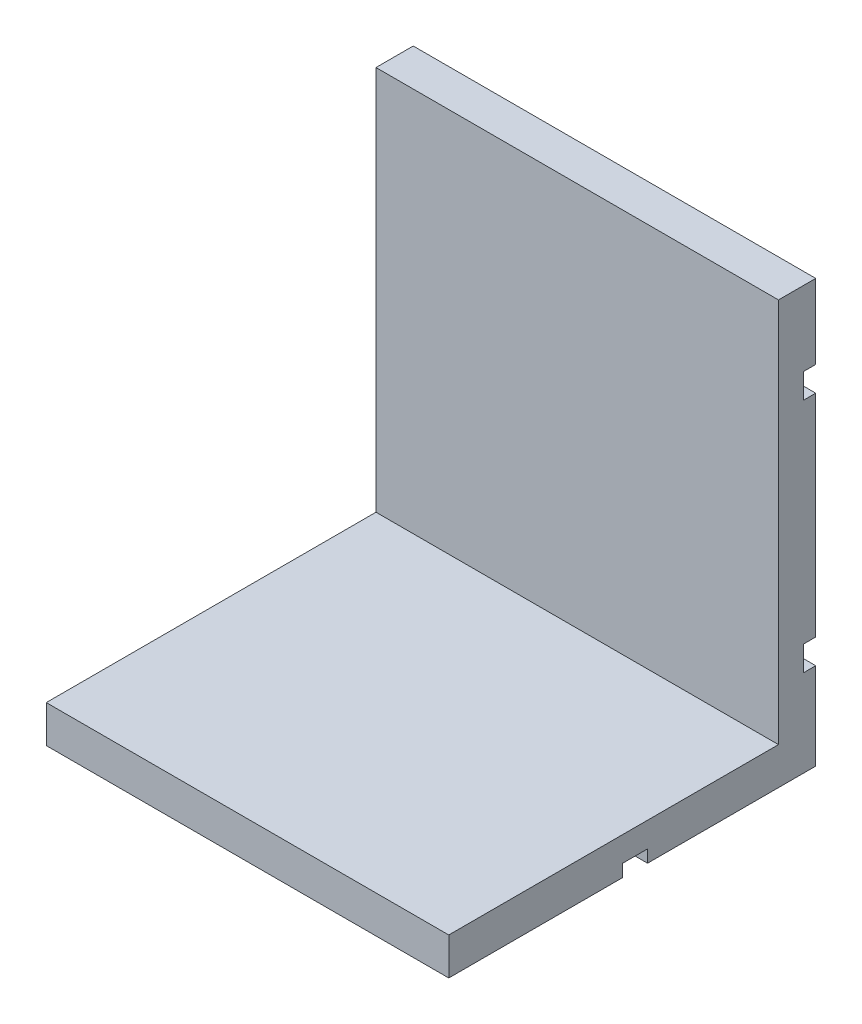
ISO-10303-21;
HEADER;
FILE_DESCRIPTION(('STEP AP214'),'2;1');
FILE_NAME('part.step','',(''),(''),'','','');
FILE_SCHEMA(('AUTOMOTIVE_DESIGN { 1 0 10303 214 1 1 1 1 }'));
ENDSEC;
DATA;
#1=APPLICATION_CONTEXT('core data for automotive mechanical design processes');
#2=APPLICATION_PROTOCOL_DEFINITION('international standard','automotive_design',2000,#1);
#3=PRODUCT_CONTEXT('',#1,'mechanical');
#4=PRODUCT('Part','Part','',(#3));
#5=PRODUCT_RELATED_PRODUCT_CATEGORY('part','',(#4));
#6=PRODUCT_DEFINITION_FORMATION('','',#4);
#7=PRODUCT_DEFINITION_CONTEXT('part definition',#1,'design');
#8=PRODUCT_DEFINITION('design','',#6,#7);
#9=PRODUCT_DEFINITION_SHAPE('','',#8);
#10=(LENGTH_UNIT() NAMED_UNIT(*) SI_UNIT(.MILLI.,.METRE.));
#11=(NAMED_UNIT(*) PLANE_ANGLE_UNIT() SI_UNIT($,.RADIAN.));
#12=(NAMED_UNIT(*) SI_UNIT($,.STERADIAN.) SOLID_ANGLE_UNIT());
#13=UNCERTAINTY_MEASURE_WITH_UNIT(LENGTH_MEASURE(1.E-05),#10,'distance_accuracy_value','');
#14=(GEOMETRIC_REPRESENTATION_CONTEXT(3) GLOBAL_UNCERTAINTY_ASSIGNED_CONTEXT((#13)) GLOBAL_UNIT_ASSIGNED_CONTEXT((#10,
#11,#12)) REPRESENTATION_CONTEXT('',''));
#15=CARTESIAN_POINT('',(0.,0.,0.));
#16=DIRECTION('',(0.,0.,1.));
#17=DIRECTION('',(1.,0.,0.));
#18=AXIS2_PLACEMENT_3D('',#15,#16,#17);
#19=CARTESIAN_POINT('',(16.2,0.,14.77));
#20=DIRECTION('',(0.,0.,-1.));
#21=DIRECTION('',(-1.,0.,0.));
#22=AXIS2_PLACEMENT_3D('',#19,#20,#21);
#23=PLANE('',#22);
#24=DIRECTION('',(0.,-1.,0.));
#25=VECTOR('',#24,1.);
#26=CARTESIAN_POINT('',(0.,0.,14.77));
#27=LINE('',#26,#25);
#28=CARTESIAN_POINT('',(0.,1.5,14.77));
#29=VERTEX_POINT('',#28);
#30=CARTESIAN_POINT('',(0.,0.,14.77));
#31=VERTEX_POINT('',#30);
#32=EDGE_CURVE('E193',#29,#31,#27,.T.);
#33=ORIENTED_EDGE('',*,*,#32,.T.);
#34=DIRECTION('',(-1.,0.,0.));
#35=VECTOR('',#34,1.);
#36=CARTESIAN_POINT('',(16.2,0.,14.77));
#37=LINE('',#36,#35);
#38=CARTESIAN_POINT('',(16.2,0.,14.77));
#39=VERTEX_POINT('',#38);
#40=EDGE_CURVE('E11',#39,#31,#37,.T.);
#41=ORIENTED_EDGE('',*,*,#40,.F.);
#42=DIRECTION('',(0.,-1.,0.));
#43=VECTOR('',#42,1.);
#44=CARTESIAN_POINT('',(16.2,0.,14.77));
#45=LINE('',#44,#43);
#46=CARTESIAN_POINT('',(16.2,1.5,14.77));
#47=VERTEX_POINT('',#46);
#48=EDGE_CURVE('E229',#47,#39,#45,.T.);
#49=ORIENTED_EDGE('',*,*,#48,.F.);
#50=DIRECTION('',(-1.,0.,0.));
#51=VECTOR('',#50,1.);
#52=CARTESIAN_POINT('',(16.2,1.5,14.77));
#53=LINE('',#52,#51);
#54=EDGE_CURVE('E189',#47,#29,#53,.T.);
#55=ORIENTED_EDGE('',*,*,#54,.T.);
#56=EDGE_LOOP('',(#33,#41,#49,#55));
#57=FACE_BOUND('',#56,.T.);
#58=ADVANCED_FACE('F37',(#57),#23,.F.);
#59=CARTESIAN_POINT('',(16.2,0.,0.));
#60=DIRECTION('',(0.,1.,0.));
#61=DIRECTION('',(0.,0.,1.));
#62=AXIS2_PLACEMENT_3D('',#59,#60,#61);
#63=PLANE('',#62);
#64=DIRECTION('',(0.,0.,-1.));
#65=VECTOR('',#64,1.);
#66=CARTESIAN_POINT('',(0.,0.,0.));
#67=LINE('',#66,#65);
#68=CARTESIAN_POINT('',(0.,0.,7.77));
#69=VERTEX_POINT('',#68);
#70=EDGE_CURVE('E196',#31,#69,#67,.T.);
#71=ORIENTED_EDGE('',*,*,#70,.T.);
#72=DIRECTION('',(-1.,0.,0.));
#73=VECTOR('',#72,1.);
#74=CARTESIAN_POINT('',(16.2,0.,7.77));
#75=LINE('',#74,#73);
#76=CARTESIAN_POINT('',(16.2,0.,7.77));
#77=VERTEX_POINT('',#76);
#78=EDGE_CURVE('E45',#77,#69,#75,.T.);
#79=ORIENTED_EDGE('',*,*,#78,.F.);
#80=DIRECTION('',(0.,0.,-1.));
#81=VECTOR('',#80,1.);
#82=CARTESIAN_POINT('',(16.2,0.,0.));
#83=LINE('',#82,#81);
#84=EDGE_CURVE('E126',#39,#77,#83,.T.);
#85=ORIENTED_EDGE('',*,*,#84,.F.);
#86=ORIENTED_EDGE('',*,*,#40,.T.);
#87=EDGE_LOOP('',(#71,#79,#85,#86));
#88=FACE_BOUND('',#87,.T.);
#89=ADVANCED_FACE('F335',(#88),#63,.F.);
#90=CARTESIAN_POINT('',(16.2,0.,7.77));
#91=DIRECTION('',(0.,0.,1.));
#92=DIRECTION('',(1.,0.,0.));
#93=AXIS2_PLACEMENT_3D('',#90,#91,#92);
#94=PLANE('',#93);
#95=DIRECTION('',(0.,1.,0.));
#96=VECTOR('',#95,1.);
#97=CARTESIAN_POINT('',(0.,0.,7.77));
#98=LINE('',#97,#96);
#99=CARTESIAN_POINT('',(0.,0.499999999999999,7.77));
#100=VERTEX_POINT('',#99);
#101=EDGE_CURVE('E198',#69,#100,#98,.T.);
#102=ORIENTED_EDGE('',*,*,#101,.T.);
#103=DIRECTION('',(-1.,0.,0.));
#104=VECTOR('',#103,1.);
#105=CARTESIAN_POINT('',(16.2,0.499999999999999,7.77));
#106=LINE('',#105,#104);
#107=CARTESIAN_POINT('',(16.2,0.499999999999999,7.77));
#108=VERTEX_POINT('',#107);
#109=EDGE_CURVE('E264',#108,#100,#106,.T.);
#110=ORIENTED_EDGE('',*,*,#109,.F.);
#111=DIRECTION('',(0.,1.,0.));
#112=VECTOR('',#111,1.);
#113=CARTESIAN_POINT('',(16.2,0.,7.77));
#114=LINE('',#113,#112);
#115=EDGE_CURVE('E272',#77,#108,#114,.T.);
#116=ORIENTED_EDGE('',*,*,#115,.F.);
#117=ORIENTED_EDGE('',*,*,#78,.T.);
#118=EDGE_LOOP('',(#102,#110,#116,#117));
#119=FACE_BOUND('',#118,.T.);
#120=ADVANCED_FACE('F270',(#119),#94,.F.);
#121=CARTESIAN_POINT('',(16.2,0.499999999999999,0.));
#122=DIRECTION('',(0.,1.,0.));
#123=DIRECTION('',(0.,0.,1.));
#124=AXIS2_PLACEMENT_3D('',#121,#122,#123);
#125=PLANE('',#124);
#126=DIRECTION('',(0.,0.,-1.));
#127=VECTOR('',#126,1.);
#128=CARTESIAN_POINT('',(0.,0.499999999999999,0.));
#129=LINE('',#128,#127);
#130=CARTESIAN_POINT('',(0.,0.499999999999999,6.77));
#131=VERTEX_POINT('',#130);
#132=EDGE_CURVE('E200',#100,#131,#129,.T.);
#133=ORIENTED_EDGE('',*,*,#132,.T.);
#134=DIRECTION('',(-1.,0.,0.));
#135=VECTOR('',#134,1.);
#136=CARTESIAN_POINT('',(16.2,0.499999999999999,6.77));
#137=LINE('',#136,#135);
#138=CARTESIAN_POINT('',(16.2,0.499999999999999,6.77));
#139=VERTEX_POINT('',#138);
#140=EDGE_CURVE('E261',#139,#131,#137,.T.);
#141=ORIENTED_EDGE('',*,*,#140,.F.);
#142=DIRECTION('',(0.,0.,-1.));
#143=VECTOR('',#142,1.);
#144=CARTESIAN_POINT('',(16.2,0.499999999999999,0.));
#145=LINE('',#144,#143);
#146=EDGE_CURVE('E290',#108,#139,#145,.T.);
#147=ORIENTED_EDGE('',*,*,#146,.F.);
#148=ORIENTED_EDGE('',*,*,#109,.T.);
#149=EDGE_LOOP('',(#133,#141,#147,#148));
#150=FACE_BOUND('',#149,.T.);
#151=ADVANCED_FACE('F280',(#150),#125,.F.);
#152=CARTESIAN_POINT('',(16.2,0.,6.77));
#153=DIRECTION('',(0.,0.,-1.));
#154=DIRECTION('',(-1.,0.,0.));
#155=AXIS2_PLACEMENT_3D('',#152,#153,#154);
#156=PLANE('',#155);
#157=DIRECTION('',(0.,-1.,0.));
#158=VECTOR('',#157,1.);
#159=CARTESIAN_POINT('',(0.,0.,6.77));
#160=LINE('',#159,#158);
#161=CARTESIAN_POINT('',(0.,0.,6.77));
#162=VERTEX_POINT('',#161);
#163=EDGE_CURVE('E202',#131,#162,#160,.T.);
#164=ORIENTED_EDGE('',*,*,#163,.T.);
#165=DIRECTION('',(-1.,0.,0.));
#166=VECTOR('',#165,1.);
#167=CARTESIAN_POINT('',(16.2,0.,6.77));
#168=LINE('',#167,#166);
#169=CARTESIAN_POINT('',(16.2,0.,6.77));
#170=VERTEX_POINT('',#169);
#171=EDGE_CURVE('E259',#170,#162,#168,.T.);
#172=ORIENTED_EDGE('',*,*,#171,.F.);
#173=DIRECTION('',(0.,-1.,0.));
#174=VECTOR('',#173,1.);
#175=CARTESIAN_POINT('',(16.2,0.,6.77));
#176=LINE('',#175,#174);
#177=EDGE_CURVE('E286',#139,#170,#176,.T.);
#178=ORIENTED_EDGE('',*,*,#177,.F.);
#179=ORIENTED_EDGE('',*,*,#140,.T.);
#180=EDGE_LOOP('',(#164,#172,#178,#179));
#181=FACE_BOUND('',#180,.T.);
#182=ADVANCED_FACE('F284',(#181),#156,.F.);
#183=CARTESIAN_POINT('',(16.2,0.,0.));
#184=DIRECTION('',(0.,-1.,0.));
#185=DIRECTION('',(0.,0.,-1.));
#186=AXIS2_PLACEMENT_3D('',#183,#184,#185);
#187=PLANE('',#186);
#188=DIRECTION('',(0.,0.,1.));
#189=VECTOR('',#188,1.);
#190=CARTESIAN_POINT('',(0.,0.,0.));
#191=LINE('',#190,#189);
#192=CARTESIAN_POINT('',(0.,0.,0.));
#193=VERTEX_POINT('',#192);
#194=EDGE_CURVE('E205',#193,#162,#191,.T.);
#195=ORIENTED_EDGE('',*,*,#194,.F.);
#196=DIRECTION('',(-1.,0.,0.));
#197=VECTOR('',#196,1.);
#198=CARTESIAN_POINT('',(16.2,0.,0.));
#199=LINE('',#198,#197);
#200=CARTESIAN_POINT('',(16.2,0.,0.));
#201=VERTEX_POINT('',#200);
#202=EDGE_CURVE('E257',#201,#193,#199,.T.);
#203=ORIENTED_EDGE('',*,*,#202,.F.);
#204=DIRECTION('',(0.,0.,1.));
#205=VECTOR('',#204,1.);
#206=CARTESIAN_POINT('',(16.2,0.,0.));
#207=LINE('',#206,#205);
#208=EDGE_CURVE('E289',#201,#170,#207,.T.);
#209=ORIENTED_EDGE('',*,*,#208,.T.);
#210=ORIENTED_EDGE('',*,*,#171,.T.);
#211=EDGE_LOOP('',(#195,#203,#209,#210));
#212=FACE_BOUND('',#211,.T.);
#213=ADVANCED_FACE('F348',(#212),#187,.T.);
#214=CARTESIAN_POINT('',(16.2,0.,0.));
#215=DIRECTION('',(0.,0.,1.));
#216=DIRECTION('',(1.,0.,0.));
#217=AXIS2_PLACEMENT_3D('',#214,#215,#216);
#218=PLANE('',#217);
#219=DIRECTION('',(0.,1.,0.));
#220=VECTOR('',#219,1.);
#221=CARTESIAN_POINT('',(0.,0.,0.));
#222=LINE('',#221,#220);
#223=CARTESIAN_POINT('',(0.,3.5,0.));
#224=VERTEX_POINT('',#223);
#225=EDGE_CURVE('E208',#193,#224,#222,.T.);
#226=ORIENTED_EDGE('',*,*,#225,.T.);
#227=DIRECTION('',(-1.,0.,0.));
#228=VECTOR('',#227,1.);
#229=CARTESIAN_POINT('',(16.2,3.5,0.));
#230=LINE('',#229,#228);
#231=CARTESIAN_POINT('',(16.2,3.5,0.));
#232=VERTEX_POINT('',#231);
#233=EDGE_CURVE('E254',#232,#224,#230,.T.);
#234=ORIENTED_EDGE('',*,*,#233,.F.);
#235=DIRECTION('',(0.,1.,0.));
#236=VECTOR('',#235,1.);
#237=CARTESIAN_POINT('',(16.2,0.,0.));
#238=LINE('',#237,#236);
#239=EDGE_CURVE('E292',#201,#232,#238,.T.);
#240=ORIENTED_EDGE('',*,*,#239,.F.);
#241=ORIENTED_EDGE('',*,*,#202,.T.);
#242=EDGE_LOOP('',(#226,#234,#240,#241));
#243=FACE_BOUND('',#242,.T.);
#244=ADVANCED_FACE('F351',(#243),#218,.F.);
#245=CARTESIAN_POINT('',(16.2,3.5,0.));
#246=DIRECTION('',(0.,-1.,0.));
#247=DIRECTION('',(0.,0.,-1.));
#248=AXIS2_PLACEMENT_3D('',#245,#246,#247);
#249=PLANE('',#248);
#250=DIRECTION('',(0.,0.,1.));
#251=VECTOR('',#250,1.);
#252=CARTESIAN_POINT('',(0.,3.5,0.));
#253=LINE('',#252,#251);
#254=CARTESIAN_POINT('',(0.,3.5,0.5));
#255=VERTEX_POINT('',#254);
#256=EDGE_CURVE('E210',#224,#255,#253,.T.);
#257=ORIENTED_EDGE('',*,*,#256,.T.);
#258=DIRECTION('',(-1.,0.,0.));
#259=VECTOR('',#258,1.);
#260=CARTESIAN_POINT('',(16.2,3.5,0.5));
#261=LINE('',#260,#259);
#262=CARTESIAN_POINT('',(16.2,3.5,0.5));
#263=VERTEX_POINT('',#262);
#264=EDGE_CURVE('E251',#263,#255,#261,.T.);
#265=ORIENTED_EDGE('',*,*,#264,.F.);
#266=DIRECTION('',(0.,0.,1.));
#267=VECTOR('',#266,1.);
#268=CARTESIAN_POINT('',(16.2,3.5,0.));
#269=LINE('',#268,#267);
#270=EDGE_CURVE('E298',#232,#263,#269,.T.);
#271=ORIENTED_EDGE('',*,*,#270,.F.);
#272=ORIENTED_EDGE('',*,*,#233,.T.);
#273=EDGE_LOOP('',(#257,#265,#271,#272));
#274=FACE_BOUND('',#273,.T.);
#275=ADVANCED_FACE('F355',(#274),#249,.F.);
#276=CARTESIAN_POINT('',(16.2,0.,0.5));
#277=DIRECTION('',(0.,0.,1.));
#278=DIRECTION('',(1.,0.,0.));
#279=AXIS2_PLACEMENT_3D('',#276,#277,#278);
#280=PLANE('',#279);
#281=DIRECTION('',(0.,1.,0.));
#282=VECTOR('',#281,1.);
#283=CARTESIAN_POINT('',(0.,0.,0.5));
#284=LINE('',#283,#282);
#285=CARTESIAN_POINT('',(0.,4.5,0.5));
#286=VERTEX_POINT('',#285);
#287=EDGE_CURVE('E212',#255,#286,#284,.T.);
#288=ORIENTED_EDGE('',*,*,#287,.T.);
#289=DIRECTION('',(-1.,0.,0.));
#290=VECTOR('',#289,1.);
#291=CARTESIAN_POINT('',(16.2,4.5,0.5));
#292=LINE('',#291,#290);
#293=CARTESIAN_POINT('',(16.2,4.5,0.5));
#294=VERTEX_POINT('',#293);
#295=EDGE_CURVE('E248',#294,#286,#292,.T.);
#296=ORIENTED_EDGE('',*,*,#295,.F.);
#297=DIRECTION('',(0.,1.,0.));
#298=VECTOR('',#297,1.);
#299=CARTESIAN_POINT('',(16.2,0.,0.5));
#300=LINE('',#299,#298);
#301=EDGE_CURVE('E300',#263,#294,#300,.T.);
#302=ORIENTED_EDGE('',*,*,#301,.F.);
#303=ORIENTED_EDGE('',*,*,#264,.T.);
#304=EDGE_LOOP('',(#288,#296,#302,#303));
#305=FACE_BOUND('',#304,.T.);
#306=ADVANCED_FACE('F359',(#305),#280,.F.);
#307=CARTESIAN_POINT('',(16.2,4.5,0.));
#308=DIRECTION('',(0.,1.,0.));
#309=DIRECTION('',(0.,0.,1.));
#310=AXIS2_PLACEMENT_3D('',#307,#308,#309);
#311=PLANE('',#310);
#312=DIRECTION('',(0.,0.,-1.));
#313=VECTOR('',#312,1.);
#314=CARTESIAN_POINT('',(0.,4.5,0.));
#315=LINE('',#314,#313);
#316=CARTESIAN_POINT('',(0.,4.5,0.));
#317=VERTEX_POINT('',#316);
#318=EDGE_CURVE('E214',#286,#317,#315,.T.);
#319=ORIENTED_EDGE('',*,*,#318,.T.);
#320=DIRECTION('',(-1.,0.,0.));
#321=VECTOR('',#320,1.);
#322=CARTESIAN_POINT('',(16.2,4.5,0.));
#323=LINE('',#322,#321);
#324=CARTESIAN_POINT('',(16.2,4.5,0.));
#325=VERTEX_POINT('',#324);
#326=EDGE_CURVE('E245',#325,#317,#323,.T.);
#327=ORIENTED_EDGE('',*,*,#326,.F.);
#328=DIRECTION('',(0.,0.,-1.));
#329=VECTOR('',#328,1.);
#330=CARTESIAN_POINT('',(16.2,4.5,0.));
#331=LINE('',#330,#329);
#332=EDGE_CURVE('E302',#294,#325,#331,.T.);
#333=ORIENTED_EDGE('',*,*,#332,.F.);
#334=ORIENTED_EDGE('',*,*,#295,.T.);
#335=EDGE_LOOP('',(#319,#327,#333,#334));
#336=FACE_BOUND('',#335,.T.);
#337=ADVANCED_FACE('F363',(#336),#311,.F.);
#338=CARTESIAN_POINT('',(16.2,0.,0.));
#339=DIRECTION('',(0.,0.,1.));
#340=DIRECTION('',(1.,0.,0.));
#341=AXIS2_PLACEMENT_3D('',#338,#339,#340);
#342=PLANE('',#341);
#343=DIRECTION('',(0.,1.,0.));
#344=VECTOR('',#343,1.);
#345=CARTESIAN_POINT('',(0.,0.,0.));
#346=LINE('',#345,#344);
#347=CARTESIAN_POINT('',(0.,13.,0.));
#348=VERTEX_POINT('',#347);
#349=EDGE_CURVE('E216',#317,#348,#346,.T.);
#350=ORIENTED_EDGE('',*,*,#349,.T.);
#351=DIRECTION('',(-1.,0.,0.));
#352=VECTOR('',#351,1.);
#353=CARTESIAN_POINT('',(16.2,13.,0.));
#354=LINE('',#353,#352);
#355=CARTESIAN_POINT('',(16.2,13.,0.));
#356=VERTEX_POINT('',#355);
#357=EDGE_CURVE('E242',#356,#348,#354,.T.);
#358=ORIENTED_EDGE('',*,*,#357,.F.);
#359=DIRECTION('',(0.,1.,0.));
#360=VECTOR('',#359,1.);
#361=CARTESIAN_POINT('',(16.2,0.,0.));
#362=LINE('',#361,#360);
#363=EDGE_CURVE('E304',#325,#356,#362,.T.);
#364=ORIENTED_EDGE('',*,*,#363,.F.);
#365=ORIENTED_EDGE('',*,*,#326,.T.);
#366=EDGE_LOOP('',(#350,#358,#364,#365));
#367=FACE_BOUND('',#366,.T.);
#368=ADVANCED_FACE('F367',(#367),#342,.F.);
#369=CARTESIAN_POINT('',(16.2,13.,0.));
#370=DIRECTION('',(0.,-1.,0.));
#371=DIRECTION('',(0.,0.,-1.));
#372=AXIS2_PLACEMENT_3D('',#369,#370,#371);
#373=PLANE('',#372);
#374=DIRECTION('',(0.,0.,1.));
#375=VECTOR('',#374,1.);
#376=CARTESIAN_POINT('',(0.,13.,0.));
#377=LINE('',#376,#375);
#378=CARTESIAN_POINT('',(0.,13.,0.5));
#379=VERTEX_POINT('',#378);
#380=EDGE_CURVE('E218',#348,#379,#377,.T.);
#381=ORIENTED_EDGE('',*,*,#380,.T.);
#382=DIRECTION('',(-1.,0.,0.));
#383=VECTOR('',#382,1.);
#384=CARTESIAN_POINT('',(16.2,13.,0.5));
#385=LINE('',#384,#383);
#386=CARTESIAN_POINT('',(16.2,13.,0.5));
#387=VERTEX_POINT('',#386);
#388=EDGE_CURVE('E239',#387,#379,#385,.T.);
#389=ORIENTED_EDGE('',*,*,#388,.F.);
#390=DIRECTION('',(0.,0.,1.));
#391=VECTOR('',#390,1.);
#392=CARTESIAN_POINT('',(16.2,13.,0.));
#393=LINE('',#392,#391);
#394=EDGE_CURVE('E306',#356,#387,#393,.T.);
#395=ORIENTED_EDGE('',*,*,#394,.F.);
#396=ORIENTED_EDGE('',*,*,#357,.T.);
#397=EDGE_LOOP('',(#381,#389,#395,#396));
#398=FACE_BOUND('',#397,.T.);
#399=ADVANCED_FACE('F371',(#398),#373,.F.);
#400=CARTESIAN_POINT('',(16.2,0.,0.5));
#401=DIRECTION('',(0.,0.,1.));
#402=DIRECTION('',(1.,0.,0.));
#403=AXIS2_PLACEMENT_3D('',#400,#401,#402);
#404=PLANE('',#403);
#405=DIRECTION('',(0.,1.,0.));
#406=VECTOR('',#405,1.);
#407=CARTESIAN_POINT('',(0.,0.,0.5));
#408=LINE('',#407,#406);
#409=CARTESIAN_POINT('',(0.,14.,0.5));
#410=VERTEX_POINT('',#409);
#411=EDGE_CURVE('E220',#379,#410,#408,.T.);
#412=ORIENTED_EDGE('',*,*,#411,.T.);
#413=DIRECTION('',(-1.,0.,0.));
#414=VECTOR('',#413,1.);
#415=CARTESIAN_POINT('',(16.2,14.,0.5));
#416=LINE('',#415,#414);
#417=CARTESIAN_POINT('',(16.2,14.,0.5));
#418=VERTEX_POINT('',#417);
#419=EDGE_CURVE('E236',#418,#410,#416,.T.);
#420=ORIENTED_EDGE('',*,*,#419,.F.);
#421=DIRECTION('',(0.,1.,0.));
#422=VECTOR('',#421,1.);
#423=CARTESIAN_POINT('',(16.2,0.,0.5));
#424=LINE('',#423,#422);
#425=EDGE_CURVE('E308',#387,#418,#424,.T.);
#426=ORIENTED_EDGE('',*,*,#425,.F.);
#427=ORIENTED_EDGE('',*,*,#388,.T.);
#428=EDGE_LOOP('',(#412,#420,#426,#427));
#429=FACE_BOUND('',#428,.T.);
#430=ADVANCED_FACE('F375',(#429),#404,.F.);
#431=CARTESIAN_POINT('',(16.2,14.,0.));
#432=DIRECTION('',(0.,1.,0.));
#433=DIRECTION('',(0.,0.,1.));
#434=AXIS2_PLACEMENT_3D('',#431,#432,#433);
#435=PLANE('',#434);
#436=DIRECTION('',(0.,0.,-1.));
#437=VECTOR('',#436,1.);
#438=CARTESIAN_POINT('',(0.,14.,0.));
#439=LINE('',#438,#437);
#440=CARTESIAN_POINT('',(0.,14.,0.));
#441=VERTEX_POINT('',#440);
#442=EDGE_CURVE('E222',#410,#441,#439,.T.);
#443=ORIENTED_EDGE('',*,*,#442,.T.);
#444=DIRECTION('',(-1.,0.,0.));
#445=VECTOR('',#444,1.);
#446=CARTESIAN_POINT('',(16.2,14.,0.));
#447=LINE('',#446,#445);
#448=CARTESIAN_POINT('',(16.2,14.,0.));
#449=VERTEX_POINT('',#448);
#450=EDGE_CURVE('E233',#449,#441,#447,.T.);
#451=ORIENTED_EDGE('',*,*,#450,.F.);
#452=DIRECTION('',(0.,0.,-1.));
#453=VECTOR('',#452,1.);
#454=CARTESIAN_POINT('',(16.2,14.,0.));
#455=LINE('',#454,#453);
#456=EDGE_CURVE('E310',#418,#449,#455,.T.);
#457=ORIENTED_EDGE('',*,*,#456,.F.);
#458=ORIENTED_EDGE('',*,*,#419,.T.);
#459=EDGE_LOOP('',(#443,#451,#457,#458));
#460=FACE_BOUND('',#459,.T.);
#461=ADVANCED_FACE('F316',(#460),#435,.F.);
#462=CARTESIAN_POINT('',(16.2,0.,0.));
#463=DIRECTION('',(0.,0.,1.));
#464=DIRECTION('',(1.,0.,0.));
#465=AXIS2_PLACEMENT_3D('',#462,#463,#464);
#466=PLANE('',#465);
#467=DIRECTION('',(0.,1.,0.));
#468=VECTOR('',#467,1.);
#469=CARTESIAN_POINT('',(0.,0.,0.));
#470=LINE('',#469,#468);
#471=CARTESIAN_POINT('',(0.,17.,0.));
#472=VERTEX_POINT('',#471);
#473=EDGE_CURVE('E224',#441,#472,#470,.T.);
#474=ORIENTED_EDGE('',*,*,#473,.T.);
#475=DIRECTION('',(-1.,0.,0.));
#476=VECTOR('',#475,1.);
#477=CARTESIAN_POINT('',(16.2,17.,0.));
#478=LINE('',#477,#476);
#479=CARTESIAN_POINT('',(16.2,17.,0.));
#480=VERTEX_POINT('',#479);
#481=EDGE_CURVE('E184',#480,#472,#478,.T.);
#482=ORIENTED_EDGE('',*,*,#481,.F.);
#483=DIRECTION('',(0.,1.,0.));
#484=VECTOR('',#483,1.);
#485=CARTESIAN_POINT('',(16.2,0.,0.));
#486=LINE('',#485,#484);
#487=EDGE_CURVE('E175',#449,#480,#486,.T.);
#488=ORIENTED_EDGE('',*,*,#487,.F.);
#489=ORIENTED_EDGE('',*,*,#450,.T.);
#490=EDGE_LOOP('',(#474,#482,#488,#489));
#491=FACE_BOUND('',#490,.T.);
#492=ADVANCED_FACE('F320',(#491),#466,.F.);
#493=CARTESIAN_POINT('',(16.2,17.,0.));
#494=DIRECTION('',(0.,-1.,0.));
#495=DIRECTION('',(0.,0.,-1.));
#496=AXIS2_PLACEMENT_3D('',#493,#494,#495);
#497=PLANE('',#496);
#498=DIRECTION('',(0.,0.,1.));
#499=VECTOR('',#498,1.);
#500=CARTESIAN_POINT('',(0.,17.,0.));
#501=LINE('',#500,#499);
#502=CARTESIAN_POINT('',(0.,17.,1.5));
#503=VERTEX_POINT('',#502);
#504=EDGE_CURVE('E183',#472,#503,#501,.T.);
#505=ORIENTED_EDGE('',*,*,#504,.T.);
#506=DIRECTION('',(-1.,0.,0.));
#507=VECTOR('',#506,1.);
#508=CARTESIAN_POINT('',(16.2,17.,1.5));
#509=LINE('',#508,#507);
#510=CARTESIAN_POINT('',(16.2,17.,1.5));
#511=VERTEX_POINT('',#510);
#512=EDGE_CURVE('E180',#511,#503,#509,.T.);
#513=ORIENTED_EDGE('',*,*,#512,.F.);
#514=DIRECTION('',(0.,0.,1.));
#515=VECTOR('',#514,1.);
#516=CARTESIAN_POINT('',(16.2,17.,0.));
#517=LINE('',#516,#515);
#518=EDGE_CURVE('E169',#480,#511,#517,.T.);
#519=ORIENTED_EDGE('',*,*,#518,.F.);
#520=ORIENTED_EDGE('',*,*,#481,.T.);
#521=EDGE_LOOP('',(#505,#513,#519,#520));
#522=FACE_BOUND('',#521,.T.);
#523=ADVANCED_FACE('F181',(#522),#497,.F.);
#524=CARTESIAN_POINT('',(16.2,0.,1.5));
#525=DIRECTION('',(0.,0.,-1.));
#526=DIRECTION('',(0.,1.,0.));
#527=AXIS2_PLACEMENT_3D('',#524,#525,#526);
#528=PLANE('',#527);
#529=DIRECTION('',(0.,-1.,0.));
#530=VECTOR('',#529,1.);
#531=CARTESIAN_POINT('',(0.,0.,1.5));
#532=LINE('',#531,#530);
#533=CARTESIAN_POINT('',(0.,1.5,1.5));
#534=VERTEX_POINT('',#533);
#535=EDGE_CURVE('E112',#503,#534,#532,.T.);
#536=ORIENTED_EDGE('',*,*,#535,.T.);
#537=DIRECTION('',(-1.,0.,0.));
#538=VECTOR('',#537,1.);
#539=CARTESIAN_POINT('',(16.2,1.5,1.5));
#540=LINE('',#539,#538);
#541=CARTESIAN_POINT('',(16.2,1.5,1.5));
#542=VERTEX_POINT('',#541);
#543=EDGE_CURVE('E185',#542,#534,#540,.T.);
#544=ORIENTED_EDGE('',*,*,#543,.F.);
#545=DIRECTION('',(0.,-1.,0.));
#546=VECTOR('',#545,1.);
#547=CARTESIAN_POINT('',(16.2,0.,1.5));
#548=LINE('',#547,#546);
#549=EDGE_CURVE('E173',#511,#542,#548,.T.);
#550=ORIENTED_EDGE('',*,*,#549,.F.);
#551=ORIENTED_EDGE('',*,*,#512,.T.);
#552=EDGE_LOOP('',(#536,#544,#550,#551));
#553=FACE_BOUND('',#552,.T.);
#554=ADVANCED_FACE('F187',(#553),#528,.F.);
#555=CARTESIAN_POINT('',(16.2,1.5,0.));
#556=DIRECTION('',(0.,-1.,0.));
#557=DIRECTION('',(0.,0.,-1.));
#558=AXIS2_PLACEMENT_3D('',#555,#556,#557);
#559=PLANE('',#558);
#560=DIRECTION('',(0.,0.,1.));
#561=VECTOR('',#560,1.);
#562=CARTESIAN_POINT('',(0.,1.5,0.));
#563=LINE('',#562,#561);
#564=EDGE_CURVE('E118',#534,#29,#563,.T.);
#565=ORIENTED_EDGE('',*,*,#564,.T.);
#566=ORIENTED_EDGE('',*,*,#54,.F.);
#567=DIRECTION('',(0.,0.,1.));
#568=VECTOR('',#567,1.);
#569=CARTESIAN_POINT('',(16.2,1.5,0.));
#570=LINE('',#569,#568);
#571=EDGE_CURVE('E53',#542,#47,#570,.T.);
#572=ORIENTED_EDGE('',*,*,#571,.F.);
#573=ORIENTED_EDGE('',*,*,#543,.T.);
#574=EDGE_LOOP('',(#565,#566,#572,#573));
#575=FACE_BOUND('',#574,.T.);
#576=ADVANCED_FACE('F324',(#575),#559,.F.);
#577=CARTESIAN_POINT('',(16.2,0.,0.));
#578=DIRECTION('',(1.,0.,0.));
#579=DIRECTION('',(0.,0.,-1.));
#580=AXIS2_PLACEMENT_3D('',#577,#578,#579);
#581=PLANE('',#580);
#582=ORIENTED_EDGE('',*,*,#48,.T.);
#583=ORIENTED_EDGE('',*,*,#84,.T.);
#584=ORIENTED_EDGE('',*,*,#115,.T.);
#585=ORIENTED_EDGE('',*,*,#146,.T.);
#586=ORIENTED_EDGE('',*,*,#177,.T.);
#587=ORIENTED_EDGE('',*,*,#208,.F.);
#588=ORIENTED_EDGE('',*,*,#239,.T.);
#589=ORIENTED_EDGE('',*,*,#270,.T.);
#590=ORIENTED_EDGE('',*,*,#301,.T.);
#591=ORIENTED_EDGE('',*,*,#332,.T.);
#592=ORIENTED_EDGE('',*,*,#363,.T.);
#593=ORIENTED_EDGE('',*,*,#394,.T.);
#594=ORIENTED_EDGE('',*,*,#425,.T.);
#595=ORIENTED_EDGE('',*,*,#456,.T.);
#596=ORIENTED_EDGE('',*,*,#487,.T.);
#597=ORIENTED_EDGE('',*,*,#518,.T.);
#598=ORIENTED_EDGE('',*,*,#549,.T.);
#599=ORIENTED_EDGE('',*,*,#571,.T.);
#600=EDGE_LOOP('',(#582,#583,#584,#585,#586,#587,#588,#589,#590,#591,#592,#593,#594,#595,#596,
#597,#598,#599));
#601=FACE_BOUND('',#600,.T.);
#602=ADVANCED_FACE('F171',(#601),#581,.T.);
#603=CARTESIAN_POINT('',(0.,0.,0.));
#604=DIRECTION('',(1.,0.,0.));
#605=DIRECTION('',(0.,0.,-1.));
#606=AXIS2_PLACEMENT_3D('',#603,#604,#605);
#607=PLANE('',#606);
#608=ORIENTED_EDGE('',*,*,#32,.F.);
#609=ORIENTED_EDGE('',*,*,#564,.F.);
#610=ORIENTED_EDGE('',*,*,#535,.F.);
#611=ORIENTED_EDGE('',*,*,#504,.F.);
#612=ORIENTED_EDGE('',*,*,#473,.F.);
#613=ORIENTED_EDGE('',*,*,#442,.F.);
#614=ORIENTED_EDGE('',*,*,#411,.F.);
#615=ORIENTED_EDGE('',*,*,#380,.F.);
#616=ORIENTED_EDGE('',*,*,#349,.F.);
#617=ORIENTED_EDGE('',*,*,#318,.F.);
#618=ORIENTED_EDGE('',*,*,#287,.F.);
#619=ORIENTED_EDGE('',*,*,#256,.F.);
#620=ORIENTED_EDGE('',*,*,#225,.F.);
#621=ORIENTED_EDGE('',*,*,#194,.T.);
#622=ORIENTED_EDGE('',*,*,#163,.F.);
#623=ORIENTED_EDGE('',*,*,#132,.F.);
#624=ORIENTED_EDGE('',*,*,#101,.F.);
#625=ORIENTED_EDGE('',*,*,#70,.F.);
#626=EDGE_LOOP('',(#608,#609,#610,#611,#612,#613,#614,#615,#616,#617,#618,#619,#620,#621,#622,
#623,#624,#625));
#627=FACE_BOUND('',#626,.T.);
#628=ADVANCED_FACE('F276',(#627),#607,.F.);
#629=CLOSED_SHELL('',(#58,#89,#120,#151,#182,#213,#244,#275,#306,#337,#368,#399,#430,#461,#492,
#523,#554,#576,#602,#628));
#630=MANIFOLD_SOLID_BREP('B2',#629);
#631=ADVANCED_BREP_SHAPE_REPRESENTATION('',(#18,#630),#14);
#632=SHAPE_DEFINITION_REPRESENTATION(#9,#631);
ENDSEC;
END-ISO-10303-21;
